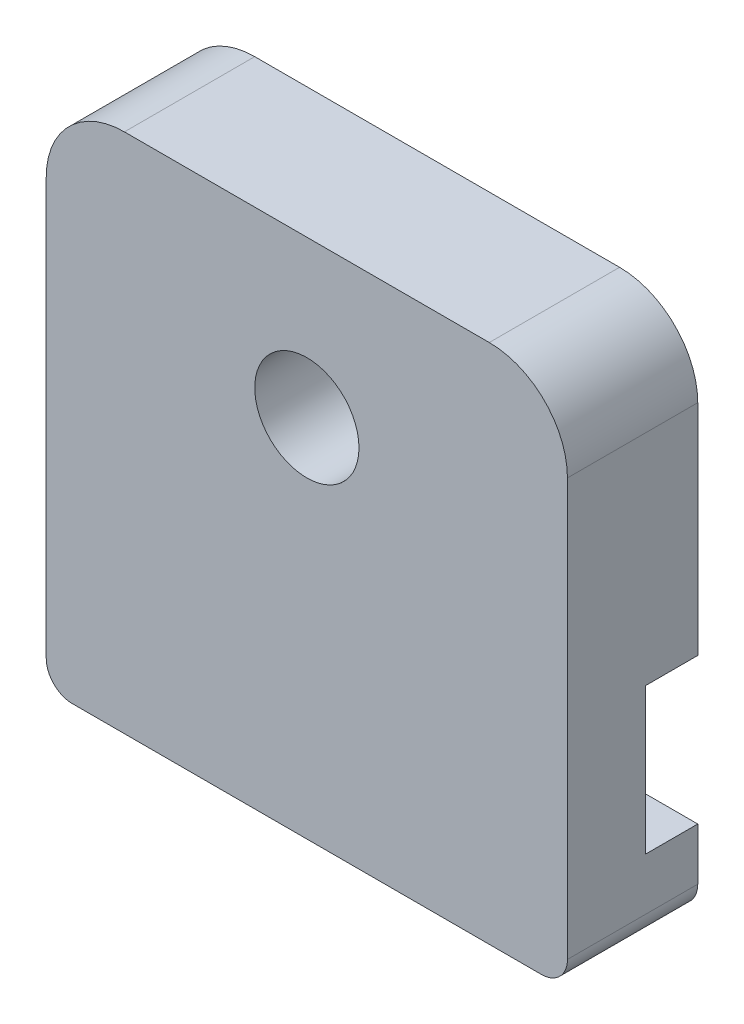
ISO-10303-21;
HEADER;
FILE_DESCRIPTION(('STEP AP214'),'2;1');
FILE_NAME('part.step','',(''),(''),'','','');
FILE_SCHEMA(('AUTOMOTIVE_DESIGN { 1 0 10303 214 1 1 1 1 }'));
ENDSEC;
DATA;
#1=APPLICATION_CONTEXT('core data for automotive mechanical design processes');
#2=APPLICATION_PROTOCOL_DEFINITION('international standard','automotive_design',2000,#1);
#3=PRODUCT_CONTEXT('',#1,'mechanical');
#4=PRODUCT('Part','Part','',(#3));
#5=PRODUCT_RELATED_PRODUCT_CATEGORY('part','',(#4));
#6=PRODUCT_DEFINITION_FORMATION('','',#4);
#7=PRODUCT_DEFINITION_CONTEXT('part definition',#1,'design');
#8=PRODUCT_DEFINITION('design','',#6,#7);
#9=PRODUCT_DEFINITION_SHAPE('','',#8);
#10=(LENGTH_UNIT() NAMED_UNIT(*) SI_UNIT(.MILLI.,.METRE.));
#11=(NAMED_UNIT(*) PLANE_ANGLE_UNIT() SI_UNIT($,.RADIAN.));
#12=(NAMED_UNIT(*) SI_UNIT($,.STERADIAN.) SOLID_ANGLE_UNIT());
#13=UNCERTAINTY_MEASURE_WITH_UNIT(LENGTH_MEASURE(1.E-05),#10,'distance_accuracy_value','');
#14=(GEOMETRIC_REPRESENTATION_CONTEXT(3) GLOBAL_UNCERTAINTY_ASSIGNED_CONTEXT((#13)) GLOBAL_UNIT_ASSIGNED_CONTEXT((#10,
#11,#12)) REPRESENTATION_CONTEXT('',''));
#15=CARTESIAN_POINT('',(0.,0.,0.));
#16=DIRECTION('',(0.,0.,1.));
#17=DIRECTION('',(1.,0.,0.));
#18=AXIS2_PLACEMENT_3D('',#15,#16,#17);
#19=CARTESIAN_POINT('',(0.,0.,0.));
#20=DIRECTION('',(0.,0.,-1.));
#21=DIRECTION('',(-1.,0.,0.));
#22=AXIS2_PLACEMENT_3D('',#19,#20,#21);
#23=PLANE('',#22);
#24=DIRECTION('',(1.,0.,0.));
#25=VECTOR('',#24,1.);
#26=CARTESIAN_POINT('',(10.,-1.4,0.));
#27=LINE('',#26,#25);
#28=CARTESIAN_POINT('',(-10.,-1.4,0.));
#29=VERTEX_POINT('',#28);
#30=CARTESIAN_POINT('',(10.,-1.4,0.));
#31=VERTEX_POINT('',#30);
#32=EDGE_CURVE('E145',#29,#31,#27,.T.);
#33=ORIENTED_EDGE('',*,*,#32,.F.);
#34=DIRECTION('',(0.,-1.,0.));
#35=VECTOR('',#34,1.);
#36=CARTESIAN_POINT('',(-10.,-10.,0.));
#37=LINE('',#36,#35);
#38=CARTESIAN_POINT('',(-10.,7.,0.));
#39=VERTEX_POINT('',#38);
#40=EDGE_CURVE('E194',#39,#29,#37,.T.);
#41=ORIENTED_EDGE('',*,*,#40,.F.);
#42=CARTESIAN_POINT('',(-7.,7.,0.));
#43=DIRECTION('',(0.,0.,-1.));
#44=DIRECTION('',(-1.,0.,0.));
#45=AXIS2_PLACEMENT_3D('',#42,#43,#44);
#46=CIRCLE('',#45,3.);
#47=CARTESIAN_POINT('',(-7.,10.,0.));
#48=VERTEX_POINT('',#47);
#49=EDGE_CURVE('E208',#39,#48,#46,.T.);
#50=ORIENTED_EDGE('',*,*,#49,.T.);
#51=DIRECTION('',(-1.,0.,0.));
#52=VECTOR('',#51,1.);
#53=CARTESIAN_POINT('',(-10.,10.,0.));
#54=LINE('',#53,#52);
#55=CARTESIAN_POINT('',(7.,10.,0.));
#56=VERTEX_POINT('',#55);
#57=EDGE_CURVE('E189',#56,#48,#54,.T.);
#58=ORIENTED_EDGE('',*,*,#57,.F.);
#59=CARTESIAN_POINT('',(7.,7.,0.));
#60=DIRECTION('',(0.,0.,-1.));
#61=DIRECTION('',(-1.,0.,0.));
#62=AXIS2_PLACEMENT_3D('',#59,#60,#61);
#63=CIRCLE('',#62,3.);
#64=CARTESIAN_POINT('',(10.,7.,0.));
#65=VERTEX_POINT('',#64);
#66=EDGE_CURVE('E204',#56,#65,#63,.T.);
#67=ORIENTED_EDGE('',*,*,#66,.T.);
#68=DIRECTION('',(0.,1.,0.));
#69=VECTOR('',#68,1.);
#70=CARTESIAN_POINT('',(10.,-10.,0.));
#71=LINE('',#70,#69);
#72=EDGE_CURVE('E165',#31,#65,#71,.T.);
#73=ORIENTED_EDGE('',*,*,#72,.F.);
#74=EDGE_LOOP('',(#33,#41,#50,#58,#67,#73));
#75=FACE_BOUND('',#74,.T.);
#76=CARTESIAN_POINT('',(0.,4.,0.));
#77=DIRECTION('',(0.,0.,1.));
#78=DIRECTION('',(1.,0.,0.));
#79=AXIS2_PLACEMENT_3D('',#76,#77,#78);
#80=CIRCLE('',#79,2.);
#81=CARTESIAN_POINT('',(2.,4.,0.));
#82=VERTEX_POINT('',#81);
#83=EDGE_CURVE('E161',#82,#82,#80,.T.);
#84=ORIENTED_EDGE('',*,*,#83,.T.);
#85=EDGE_LOOP('',(#84));
#86=FACE_BOUND('',#85,.T.);
#87=ADVANCED_FACE('F39',(#75,#86),#23,.T.);
#88=CARTESIAN_POINT('',(10.,-10.,5.));
#89=DIRECTION('',(-1.,0.,0.));
#90=DIRECTION('',(0.,0.,1.));
#91=AXIS2_PLACEMENT_3D('',#88,#89,#90);
#92=PLANE('',#91);
#93=DIRECTION('',(0.,-1.,0.));
#94=VECTOR('',#93,1.);
#95=CARTESIAN_POINT('',(10.,-7.,2.));
#96=LINE('',#95,#94);
#97=CARTESIAN_POINT('',(10.,-1.4,2.));
#98=VERTEX_POINT('',#97);
#99=CARTESIAN_POINT('',(10.,-7.,2.));
#100=VERTEX_POINT('',#99);
#101=EDGE_CURVE('E135',#98,#100,#96,.T.);
#102=ORIENTED_EDGE('',*,*,#101,.F.);
#103=DIRECTION('',(0.,0.,-1.));
#104=VECTOR('',#103,1.);
#105=CARTESIAN_POINT('',(10.,-1.4,2.));
#106=LINE('',#105,#104);
#107=EDGE_CURVE('E170',#98,#31,#106,.T.);
#108=ORIENTED_EDGE('',*,*,#107,.T.);
#109=ORIENTED_EDGE('',*,*,#72,.T.);
#110=DIRECTION('',(0.,0.,-1.));
#111=VECTOR('',#110,1.);
#112=CARTESIAN_POINT('',(10.,7.,5.));
#113=LINE('',#112,#111);
#114=CARTESIAN_POINT('',(10.,7.,5.));
#115=VERTEX_POINT('',#114);
#116=EDGE_CURVE('E224',#65,#115,#113,.F.);
#117=ORIENTED_EDGE('',*,*,#116,.T.);
#118=DIRECTION('',(0.,1.,0.));
#119=VECTOR('',#118,1.);
#120=CARTESIAN_POINT('',(10.,-10.,5.));
#121=LINE('',#120,#119);
#122=CARTESIAN_POINT('',(10.,-9.,5.));
#123=VERTEX_POINT('',#122);
#124=EDGE_CURVE('E171',#123,#115,#121,.T.);
#125=ORIENTED_EDGE('',*,*,#124,.F.);
#126=DIRECTION('',(0.,0.,-1.));
#127=VECTOR('',#126,1.);
#128=CARTESIAN_POINT('',(10.,-9.,5.));
#129=LINE('',#128,#127);
#130=CARTESIAN_POINT('',(10.,-9.,0.));
#131=VERTEX_POINT('',#130);
#132=EDGE_CURVE('E228',#123,#131,#129,.T.);
#133=ORIENTED_EDGE('',*,*,#132,.T.);
#134=CARTESIAN_POINT('',(10.,-7.,0.));
#135=VERTEX_POINT('',#134);
#136=EDGE_CURVE('E151',#131,#135,#71,.T.);
#137=ORIENTED_EDGE('',*,*,#136,.T.);
#138=DIRECTION('',(0.,0.,-1.));
#139=VECTOR('',#138,1.);
#140=CARTESIAN_POINT('',(10.,-7.,2.));
#141=LINE('',#140,#139);
#142=EDGE_CURVE('E55',#100,#135,#141,.T.);
#143=ORIENTED_EDGE('',*,*,#142,.F.);
#144=EDGE_LOOP('',(#102,#108,#109,#117,#125,#133,#137,#143));
#145=FACE_BOUND('',#144,.T.);
#146=ADVANCED_FACE('F148',(#145),#92,.F.);
#147=CARTESIAN_POINT('',(-10.,10.,5.));
#148=DIRECTION('',(0.,-1.,0.));
#149=DIRECTION('',(0.,0.,-1.));
#150=AXIS2_PLACEMENT_3D('',#147,#148,#149);
#151=PLANE('',#150);
#152=ORIENTED_EDGE('',*,*,#57,.T.);
#153=DIRECTION('',(0.,0.,-1.));
#154=VECTOR('',#153,1.);
#155=CARTESIAN_POINT('',(-7.,10.,5.));
#156=LINE('',#155,#154);
#157=CARTESIAN_POINT('',(-7.,10.,5.));
#158=VERTEX_POINT('',#157);
#159=EDGE_CURVE('E215',#48,#158,#156,.F.);
#160=ORIENTED_EDGE('',*,*,#159,.T.);
#161=DIRECTION('',(-1.,0.,0.));
#162=VECTOR('',#161,1.);
#163=CARTESIAN_POINT('',(-10.,10.,5.));
#164=LINE('',#163,#162);
#165=CARTESIAN_POINT('',(7.,10.,5.));
#166=VERTEX_POINT('',#165);
#167=EDGE_CURVE('E174',#166,#158,#164,.T.);
#168=ORIENTED_EDGE('',*,*,#167,.F.);
#169=DIRECTION('',(0.,0.,-1.));
#170=VECTOR('',#169,1.);
#171=CARTESIAN_POINT('',(7.,10.,5.));
#172=LINE('',#171,#170);
#173=EDGE_CURVE('E211',#166,#56,#172,.T.);
#174=ORIENTED_EDGE('',*,*,#173,.T.);
#175=EDGE_LOOP('',(#152,#160,#168,#174));
#176=FACE_BOUND('',#175,.T.);
#177=ADVANCED_FACE('F297',(#176),#151,.F.);
#178=CARTESIAN_POINT('',(-10.,-10.,5.));
#179=DIRECTION('',(1.,0.,0.));
#180=DIRECTION('',(0.,0.,-1.));
#181=AXIS2_PLACEMENT_3D('',#178,#179,#180);
#182=PLANE('',#181);
#183=ORIENTED_EDGE('',*,*,#40,.T.);
#184=DIRECTION('',(0.,0.,-1.));
#185=VECTOR('',#184,1.);
#186=CARTESIAN_POINT('',(-10.,-1.4,2.));
#187=LINE('',#186,#185);
#188=CARTESIAN_POINT('',(-10.,-1.4,2.));
#189=VERTEX_POINT('',#188);
#190=EDGE_CURVE('E156',#189,#29,#187,.T.);
#191=ORIENTED_EDGE('',*,*,#190,.F.);
#192=DIRECTION('',(0.,1.,0.));
#193=VECTOR('',#192,1.);
#194=CARTESIAN_POINT('',(-10.,-7.,2.));
#195=LINE('',#194,#193);
#196=CARTESIAN_POINT('',(-10.,-7.,2.));
#197=VERTEX_POINT('',#196);
#198=EDGE_CURVE('E134',#197,#189,#195,.T.);
#199=ORIENTED_EDGE('',*,*,#198,.F.);
#200=DIRECTION('',(0.,0.,-1.));
#201=VECTOR('',#200,1.);
#202=CARTESIAN_POINT('',(-10.,-7.,2.));
#203=LINE('',#202,#201);
#204=CARTESIAN_POINT('',(-10.,-7.,0.));
#205=VERTEX_POINT('',#204);
#206=EDGE_CURVE('E130',#197,#205,#203,.T.);
#207=ORIENTED_EDGE('',*,*,#206,.T.);
#208=CARTESIAN_POINT('',(-10.,-9.,0.));
#209=VERTEX_POINT('',#208);
#210=EDGE_CURVE('E193',#205,#209,#37,.T.);
#211=ORIENTED_EDGE('',*,*,#210,.T.);
#212=DIRECTION('',(0.,0.,-1.));
#213=VECTOR('',#212,1.);
#214=CARTESIAN_POINT('',(-10.,-9.,5.));
#215=LINE('',#214,#213);
#216=CARTESIAN_POINT('',(-10.,-9.,5.));
#217=VERTEX_POINT('',#216);
#218=EDGE_CURVE('E11',#209,#217,#215,.F.);
#219=ORIENTED_EDGE('',*,*,#218,.T.);
#220=DIRECTION('',(0.,-1.,0.));
#221=VECTOR('',#220,1.);
#222=CARTESIAN_POINT('',(-10.,-10.,5.));
#223=LINE('',#222,#221);
#224=CARTESIAN_POINT('',(-10.,7.,5.));
#225=VERTEX_POINT('',#224);
#226=EDGE_CURVE('E179',#225,#217,#223,.T.);
#227=ORIENTED_EDGE('',*,*,#226,.F.);
#228=DIRECTION('',(0.,0.,-1.));
#229=VECTOR('',#228,1.);
#230=CARTESIAN_POINT('',(-10.,7.,5.));
#231=LINE('',#230,#229);
#232=EDGE_CURVE('E186',#225,#39,#231,.T.);
#233=ORIENTED_EDGE('',*,*,#232,.T.);
#234=EDGE_LOOP('',(#183,#191,#199,#207,#211,#219,#227,#233));
#235=FACE_BOUND('',#234,.T.);
#236=ADVANCED_FACE('F284',(#235),#182,.F.);
#237=CARTESIAN_POINT('',(-10.,-10.,5.));
#238=DIRECTION('',(0.,1.,0.));
#239=DIRECTION('',(0.,0.,1.));
#240=AXIS2_PLACEMENT_3D('',#237,#238,#239);
#241=PLANE('',#240);
#242=DIRECTION('',(1.,0.,0.));
#243=VECTOR('',#242,1.);
#244=CARTESIAN_POINT('',(-10.,-10.,0.));
#245=LINE('',#244,#243);
#246=CARTESIAN_POINT('',(-9.,-10.,0.));
#247=VERTEX_POINT('',#246);
#248=CARTESIAN_POINT('',(9.,-10.,0.));
#249=VERTEX_POINT('',#248);
#250=EDGE_CURVE('E175',#247,#249,#245,.T.);
#251=ORIENTED_EDGE('',*,*,#250,.T.);
#252=DIRECTION('',(0.,0.,-1.));
#253=VECTOR('',#252,1.);
#254=CARTESIAN_POINT('',(9.,-10.,5.));
#255=LINE('',#254,#253);
#256=CARTESIAN_POINT('',(9.,-10.,5.));
#257=VERTEX_POINT('',#256);
#258=EDGE_CURVE('E242',#249,#257,#255,.F.);
#259=ORIENTED_EDGE('',*,*,#258,.T.);
#260=DIRECTION('',(1.,0.,0.));
#261=VECTOR('',#260,1.);
#262=CARTESIAN_POINT('',(-10.,-10.,5.));
#263=LINE('',#262,#261);
#264=CARTESIAN_POINT('',(-9.,-10.,5.));
#265=VERTEX_POINT('',#264);
#266=EDGE_CURVE('E182',#265,#257,#263,.T.);
#267=ORIENTED_EDGE('',*,*,#266,.F.);
#268=DIRECTION('',(0.,0.,-1.));
#269=VECTOR('',#268,1.);
#270=CARTESIAN_POINT('',(-9.,-10.,5.));
#271=LINE('',#270,#269);
#272=EDGE_CURVE('E238',#265,#247,#271,.T.);
#273=ORIENTED_EDGE('',*,*,#272,.T.);
#274=EDGE_LOOP('',(#251,#259,#267,#273));
#275=FACE_BOUND('',#274,.T.);
#276=ADVANCED_FACE('F263',(#275),#241,.F.);
#277=CARTESIAN_POINT('',(0.,0.,5.));
#278=DIRECTION('',(0.,0.,-1.));
#279=DIRECTION('',(-1.,0.,0.));
#280=AXIS2_PLACEMENT_3D('',#277,#278,#279);
#281=PLANE('',#280);
#282=CARTESIAN_POINT('',(0.,4.,5.));
#283=DIRECTION('',(0.,0.,1.));
#284=DIRECTION('',(1.,0.,0.));
#285=AXIS2_PLACEMENT_3D('',#282,#283,#284);
#286=CIRCLE('',#285,2.);
#287=CARTESIAN_POINT('',(2.,4.,5.));
#288=VERTEX_POINT('',#287);
#289=EDGE_CURVE('E166',#288,#288,#286,.T.);
#290=ORIENTED_EDGE('',*,*,#289,.F.);
#291=EDGE_LOOP('',(#290));
#292=FACE_BOUND('',#291,.T.);
#293=ORIENTED_EDGE('',*,*,#266,.T.);
#294=CARTESIAN_POINT('',(9.,-9.,5.));
#295=DIRECTION('',(0.,0.,-1.));
#296=DIRECTION('',(-1.,0.,0.));
#297=AXIS2_PLACEMENT_3D('',#294,#295,#296);
#298=CIRCLE('',#297,1.);
#299=EDGE_CURVE('E48',#257,#123,#298,.F.);
#300=ORIENTED_EDGE('',*,*,#299,.T.);
#301=ORIENTED_EDGE('',*,*,#124,.T.);
#302=CARTESIAN_POINT('',(7.,7.,5.));
#303=DIRECTION('',(0.,0.,-1.));
#304=DIRECTION('',(-1.,0.,0.));
#305=AXIS2_PLACEMENT_3D('',#302,#303,#304);
#306=CIRCLE('',#305,3.);
#307=EDGE_CURVE('E218',#115,#166,#306,.F.);
#308=ORIENTED_EDGE('',*,*,#307,.T.);
#309=ORIENTED_EDGE('',*,*,#167,.T.);
#310=CARTESIAN_POINT('',(-7.,7.,5.));
#311=DIRECTION('',(0.,0.,-1.));
#312=DIRECTION('',(-1.,0.,0.));
#313=AXIS2_PLACEMENT_3D('',#310,#311,#312);
#314=CIRCLE('',#313,3.);
#315=EDGE_CURVE('E221',#158,#225,#314,.F.);
#316=ORIENTED_EDGE('',*,*,#315,.T.);
#317=ORIENTED_EDGE('',*,*,#226,.T.);
#318=CARTESIAN_POINT('',(-9.,-9.,5.));
#319=DIRECTION('',(0.,0.,-1.));
#320=DIRECTION('',(-1.,0.,0.));
#321=AXIS2_PLACEMENT_3D('',#318,#319,#320);
#322=CIRCLE('',#321,1.);
#323=EDGE_CURVE('E245',#217,#265,#322,.F.);
#324=ORIENTED_EDGE('',*,*,#323,.T.);
#325=EDGE_LOOP('',(#293,#300,#301,#308,#309,#316,#317,#324));
#326=FACE_BOUND('',#325,.T.);
#327=ADVANCED_FACE('F251',(#292,#326),#281,.F.);
#328=DIRECTION('',(-1.,0.,0.));
#329=VECTOR('',#328,1.);
#330=CARTESIAN_POINT('',(10.,-7.,0.));
#331=LINE('',#330,#329);
#332=EDGE_CURVE('E268',#135,#205,#331,.T.);
#333=ORIENTED_EDGE('',*,*,#332,.F.);
#334=ORIENTED_EDGE('',*,*,#136,.F.);
#335=CARTESIAN_POINT('',(9.,-9.,0.));
#336=DIRECTION('',(0.,0.,-1.));
#337=DIRECTION('',(-1.,0.,0.));
#338=AXIS2_PLACEMENT_3D('',#335,#336,#337);
#339=CIRCLE('',#338,1.);
#340=EDGE_CURVE('E235',#131,#249,#339,.T.);
#341=ORIENTED_EDGE('',*,*,#340,.T.);
#342=ORIENTED_EDGE('',*,*,#250,.F.);
#343=CARTESIAN_POINT('',(-9.,-9.,0.));
#344=DIRECTION('',(0.,0.,-1.));
#345=DIRECTION('',(-1.,0.,0.));
#346=AXIS2_PLACEMENT_3D('',#343,#344,#345);
#347=CIRCLE('',#346,1.);
#348=EDGE_CURVE('E231',#247,#209,#347,.T.);
#349=ORIENTED_EDGE('',*,*,#348,.T.);
#350=ORIENTED_EDGE('',*,*,#210,.F.);
#351=EDGE_LOOP('',(#333,#334,#341,#342,#349,#350));
#352=FACE_BOUND('',#351,.T.);
#353=ADVANCED_FACE('F261',(#352),#23,.T.);
#354=CARTESIAN_POINT('',(0.,4.,0.));
#355=DIRECTION('',(0.,0.,1.));
#356=DIRECTION('',(1.,0.,0.));
#357=AXIS2_PLACEMENT_3D('',#354,#355,#356);
#358=CYLINDRICAL_SURFACE('',#357,2.);
#359=ORIENTED_EDGE('',*,*,#83,.F.);
#360=EDGE_LOOP('',(#359));
#361=FACE_BOUND('',#360,.T.);
#362=ORIENTED_EDGE('',*,*,#289,.T.);
#363=EDGE_LOOP('',(#362));
#364=FACE_BOUND('',#363,.T.);
#365=ADVANCED_FACE('F302',(#361,#364),#358,.F.);
#366=CARTESIAN_POINT('',(-7.,7.,5.));
#367=DIRECTION('',(0.,0.,-1.));
#368=DIRECTION('',(-1.,0.,0.));
#369=AXIS2_PLACEMENT_3D('',#366,#367,#368);
#370=CYLINDRICAL_SURFACE('',#369,3.);
#371=ORIENTED_EDGE('',*,*,#315,.F.);
#372=ORIENTED_EDGE('',*,*,#159,.F.);
#373=ORIENTED_EDGE('',*,*,#49,.F.);
#374=ORIENTED_EDGE('',*,*,#232,.F.);
#375=EDGE_LOOP('',(#371,#372,#373,#374));
#376=FACE_BOUND('',#375,.T.);
#377=ADVANCED_FACE('F300',(#376),#370,.T.);
#378=CARTESIAN_POINT('',(7.,7.,5.));
#379=DIRECTION('',(0.,0.,-1.));
#380=DIRECTION('',(-1.,0.,0.));
#381=AXIS2_PLACEMENT_3D('',#378,#379,#380);
#382=CYLINDRICAL_SURFACE('',#381,3.);
#383=ORIENTED_EDGE('',*,*,#307,.F.);
#384=ORIENTED_EDGE('',*,*,#116,.F.);
#385=ORIENTED_EDGE('',*,*,#66,.F.);
#386=ORIENTED_EDGE('',*,*,#173,.F.);
#387=EDGE_LOOP('',(#383,#384,#385,#386));
#388=FACE_BOUND('',#387,.T.);
#389=ADVANCED_FACE('F293',(#388),#382,.T.);
#390=CARTESIAN_POINT('',(9.,-9.,5.));
#391=DIRECTION('',(0.,0.,-1.));
#392=DIRECTION('',(-1.,0.,0.));
#393=AXIS2_PLACEMENT_3D('',#390,#391,#392);
#394=CYLINDRICAL_SURFACE('',#393,1.);
#395=ORIENTED_EDGE('',*,*,#299,.F.);
#396=ORIENTED_EDGE('',*,*,#258,.F.);
#397=ORIENTED_EDGE('',*,*,#340,.F.);
#398=ORIENTED_EDGE('',*,*,#132,.F.);
#399=EDGE_LOOP('',(#395,#396,#397,#398));
#400=FACE_BOUND('',#399,.T.);
#401=ADVANCED_FACE('F258',(#400),#394,.T.);
#402=CARTESIAN_POINT('',(-9.,-9.,5.));
#403=DIRECTION('',(0.,0.,-1.));
#404=DIRECTION('',(-1.,0.,0.));
#405=AXIS2_PLACEMENT_3D('',#402,#403,#404);
#406=CYLINDRICAL_SURFACE('',#405,1.);
#407=ORIENTED_EDGE('',*,*,#323,.F.);
#408=ORIENTED_EDGE('',*,*,#218,.F.);
#409=ORIENTED_EDGE('',*,*,#348,.F.);
#410=ORIENTED_EDGE('',*,*,#272,.F.);
#411=EDGE_LOOP('',(#407,#408,#409,#410));
#412=FACE_BOUND('',#411,.T.);
#413=ADVANCED_FACE('F41',(#412),#406,.T.);
#414=CARTESIAN_POINT('',(10.,-1.4,2.));
#415=DIRECTION('',(0.,1.,0.));
#416=DIRECTION('',(0.,0.,1.));
#417=AXIS2_PLACEMENT_3D('',#414,#415,#416);
#418=PLANE('',#417);
#419=ORIENTED_EDGE('',*,*,#32,.T.);
#420=ORIENTED_EDGE('',*,*,#107,.F.);
#421=DIRECTION('',(1.,0.,0.));
#422=VECTOR('',#421,1.);
#423=CARTESIAN_POINT('',(10.,-1.4,2.));
#424=LINE('',#423,#422);
#425=EDGE_CURVE('E141',#189,#98,#424,.T.);
#426=ORIENTED_EDGE('',*,*,#425,.F.);
#427=ORIENTED_EDGE('',*,*,#190,.T.);
#428=EDGE_LOOP('',(#419,#420,#426,#427));
#429=FACE_BOUND('',#428,.T.);
#430=ADVANCED_FACE('F283',(#429),#418,.F.);
#431=CARTESIAN_POINT('',(10.,-7.,2.));
#432=DIRECTION('',(0.,-1.,0.));
#433=DIRECTION('',(0.,0.,-1.));
#434=AXIS2_PLACEMENT_3D('',#431,#432,#433);
#435=PLANE('',#434);
#436=ORIENTED_EDGE('',*,*,#332,.T.);
#437=ORIENTED_EDGE('',*,*,#206,.F.);
#438=DIRECTION('',(-1.,0.,0.));
#439=VECTOR('',#438,1.);
#440=CARTESIAN_POINT('',(10.,-7.,2.));
#441=LINE('',#440,#439);
#442=EDGE_CURVE('E126',#100,#197,#441,.T.);
#443=ORIENTED_EDGE('',*,*,#442,.F.);
#444=ORIENTED_EDGE('',*,*,#142,.T.);
#445=EDGE_LOOP('',(#436,#437,#443,#444));
#446=FACE_BOUND('',#445,.T.);
#447=ADVANCED_FACE('F128',(#446),#435,.F.);
#448=CARTESIAN_POINT('',(0.,0.,2.));
#449=DIRECTION('',(0.,0.,1.));
#450=DIRECTION('',(1.,0.,0.));
#451=AXIS2_PLACEMENT_3D('',#448,#449,#450);
#452=PLANE('',#451);
#453=ORIENTED_EDGE('',*,*,#101,.T.);
#454=ORIENTED_EDGE('',*,*,#442,.T.);
#455=ORIENTED_EDGE('',*,*,#198,.T.);
#456=ORIENTED_EDGE('',*,*,#425,.T.);
#457=EDGE_LOOP('',(#453,#454,#455,#456));
#458=FACE_BOUND('',#457,.T.);
#459=ADVANCED_FACE('F139',(#458),#452,.F.);
#460=CLOSED_SHELL('',(#87,#146,#177,#236,#276,#327,#353,#365,#377,#389,#401,#413,#430,#447,#459));
#461=MANIFOLD_SOLID_BREP('B2',#460);
#462=ADVANCED_BREP_SHAPE_REPRESENTATION('',(#18,#461),#14);
#463=SHAPE_DEFINITION_REPRESENTATION(#9,#462);
ENDSEC;
END-ISO-10303-21;
